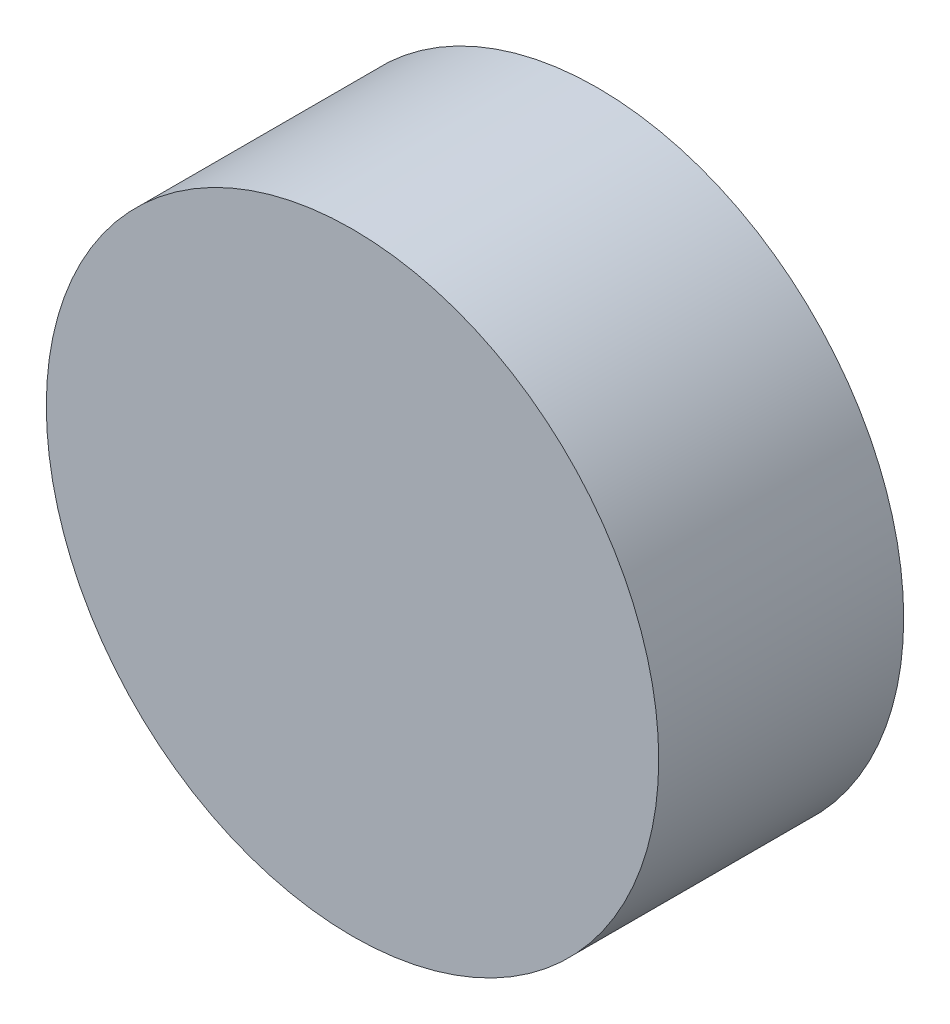
ISO-10303-21;
HEADER;
FILE_DESCRIPTION(('STEP AP214'),'2;1');
FILE_NAME('part.step','',(''),(''),'','','');
FILE_SCHEMA(('AUTOMOTIVE_DESIGN { 1 0 10303 214 1 1 1 1 }'));
ENDSEC;
DATA;
#1=APPLICATION_CONTEXT('core data for automotive mechanical design processes');
#2=APPLICATION_PROTOCOL_DEFINITION('international standard','automotive_design',2000,#1);
#3=PRODUCT_CONTEXT('',#1,'mechanical');
#4=PRODUCT('Part','Part','',(#3));
#5=PRODUCT_RELATED_PRODUCT_CATEGORY('part','',(#4));
#6=PRODUCT_DEFINITION_FORMATION('','',#4);
#7=PRODUCT_DEFINITION_CONTEXT('part definition',#1,'design');
#8=PRODUCT_DEFINITION('design','',#6,#7);
#9=PRODUCT_DEFINITION_SHAPE('','',#8);
#10=(LENGTH_UNIT() NAMED_UNIT(*) SI_UNIT(.MILLI.,.METRE.));
#11=(NAMED_UNIT(*) PLANE_ANGLE_UNIT() SI_UNIT($,.RADIAN.));
#12=(NAMED_UNIT(*) SI_UNIT($,.STERADIAN.) SOLID_ANGLE_UNIT());
#13=UNCERTAINTY_MEASURE_WITH_UNIT(LENGTH_MEASURE(1.E-05),#10,'distance_accuracy_value','');
#14=(GEOMETRIC_REPRESENTATION_CONTEXT(3) GLOBAL_UNCERTAINTY_ASSIGNED_CONTEXT((#13)) GLOBAL_UNIT_ASSIGNED_CONTEXT((#10,
#11,#12)) REPRESENTATION_CONTEXT('',''));
#15=CARTESIAN_POINT('',(0.,0.,0.));
#16=DIRECTION('',(0.,0.,1.));
#17=DIRECTION('',(1.,0.,0.));
#18=AXIS2_PLACEMENT_3D('',#15,#16,#17);
#19=CARTESIAN_POINT('',(0.,0.,2.));
#20=DIRECTION('',(0.,0.,-1.));
#21=DIRECTION('',(-1.,0.,0.));
#22=AXIS2_PLACEMENT_3D('',#19,#20,#21);
#23=CYLINDRICAL_SURFACE('',#22,2.5);
#24=CARTESIAN_POINT('',(0.,0.,2.));
#25=DIRECTION('',(0.,0.,1.));
#26=DIRECTION('',(1.,0.,0.));
#27=AXIS2_PLACEMENT_3D('',#24,#25,#26);
#28=CIRCLE('',#27,2.5);
#29=CARTESIAN_POINT('',(2.5,0.,2.));
#30=VERTEX_POINT('',#29);
#31=EDGE_CURVE('E10',#30,#30,#28,.T.);
#32=ORIENTED_EDGE('',*,*,#31,.F.);
#33=EDGE_LOOP('',(#32));
#34=FACE_BOUND('',#33,.T.);
#35=CARTESIAN_POINT('',(0.,0.,0.));
#36=DIRECTION('',(0.,0.,1.));
#37=DIRECTION('',(1.,0.,0.));
#38=AXIS2_PLACEMENT_3D('',#35,#36,#37);
#39=CIRCLE('',#38,2.5);
#40=CARTESIAN_POINT('',(2.5,0.,0.));
#41=VERTEX_POINT('',#40);
#42=EDGE_CURVE('E34',#41,#41,#39,.T.);
#43=ORIENTED_EDGE('',*,*,#42,.T.);
#44=EDGE_LOOP('',(#43));
#45=FACE_BOUND('',#44,.T.);
#46=ADVANCED_FACE('F31',(#34,#45),#23,.T.);
#47=CARTESIAN_POINT('',(0.,0.,2.));
#48=DIRECTION('',(0.,0.,1.));
#49=DIRECTION('',(1.,0.,0.));
#50=AXIS2_PLACEMENT_3D('',#47,#48,#49);
#51=PLANE('',#50);
#52=ORIENTED_EDGE('',*,*,#31,.T.);
#53=EDGE_LOOP('',(#52));
#54=FACE_BOUND('',#53,.T.);
#55=ADVANCED_FACE('F46',(#54),#51,.T.);
#56=CARTESIAN_POINT('',(0.,0.,0.));
#57=DIRECTION('',(0.,0.,1.));
#58=DIRECTION('',(1.,0.,0.));
#59=AXIS2_PLACEMENT_3D('',#56,#57,#58);
#60=PLANE('',#59);
#61=ORIENTED_EDGE('',*,*,#42,.F.);
#62=EDGE_LOOP('',(#61));
#63=FACE_BOUND('',#62,.T.);
#64=ADVANCED_FACE('F44',(#63),#60,.F.);
#65=CLOSED_SHELL('',(#46,#55,#64));
#66=MANIFOLD_SOLID_BREP('B2',#65);
#67=ADVANCED_BREP_SHAPE_REPRESENTATION('',(#18,#66),#14);
#68=SHAPE_DEFINITION_REPRESENTATION(#9,#67);
ENDSEC;
END-ISO-10303-21;
